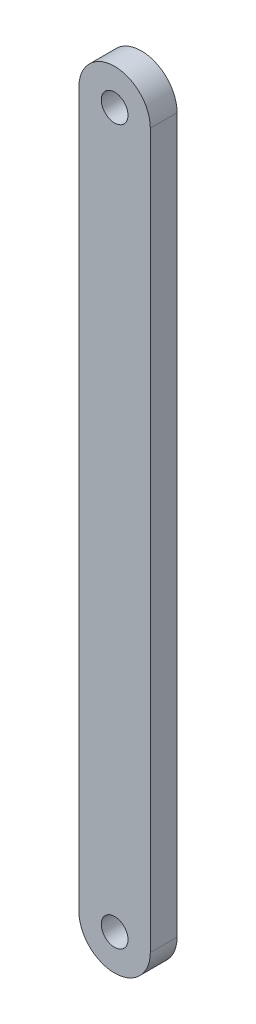
ISO-10303-21;
HEADER;
FILE_DESCRIPTION(('STEP AP214'),'2;1');
FILE_NAME('part.step','',(''),(''),'','','');
FILE_SCHEMA(('AUTOMOTIVE_DESIGN { 1 0 10303 214 1 1 1 1 }'));
ENDSEC;
DATA;
#1=APPLICATION_CONTEXT('core data for automotive mechanical design processes');
#2=APPLICATION_PROTOCOL_DEFINITION('international standard','automotive_design',2000,#1);
#3=PRODUCT_CONTEXT('',#1,'mechanical');
#4=PRODUCT('Part','Part','',(#3));
#5=PRODUCT_RELATED_PRODUCT_CATEGORY('part','',(#4));
#6=PRODUCT_DEFINITION_FORMATION('','',#4);
#7=PRODUCT_DEFINITION_CONTEXT('part definition',#1,'design');
#8=PRODUCT_DEFINITION('design','',#6,#7);
#9=PRODUCT_DEFINITION_SHAPE('','',#8);
#10=(LENGTH_UNIT() NAMED_UNIT(*) SI_UNIT(.MILLI.,.METRE.));
#11=(NAMED_UNIT(*) PLANE_ANGLE_UNIT() SI_UNIT($,.RADIAN.));
#12=(NAMED_UNIT(*) SI_UNIT($,.STERADIAN.) SOLID_ANGLE_UNIT());
#13=UNCERTAINTY_MEASURE_WITH_UNIT(LENGTH_MEASURE(1.E-05),#10,'distance_accuracy_value','');
#14=(GEOMETRIC_REPRESENTATION_CONTEXT(3) GLOBAL_UNCERTAINTY_ASSIGNED_CONTEXT((#13)) GLOBAL_UNIT_ASSIGNED_CONTEXT((#10,
#11,#12)) REPRESENTATION_CONTEXT('',''));
#15=CARTESIAN_POINT('',(0.,0.,0.));
#16=DIRECTION('',(0.,0.,1.));
#17=DIRECTION('',(1.,0.,0.));
#18=AXIS2_PLACEMENT_3D('',#15,#16,#17);
#19=CARTESIAN_POINT('',(51.4999999987979,80.0001000004622,3.));
#20=DIRECTION('',(0.,0.,1.));
#21=DIRECTION('',(1.,0.,0.));
#22=AXIS2_PLACEMENT_3D('',#19,#20,#21);
#23=PLANE('',#22);
#24=CARTESIAN_POINT('',(51.5000999977619,4.99977620052E-05,3.));
#25=DIRECTION('',(0.,0.,1.));
#26=DIRECTION('',(1.,0.,0.));
#27=AXIS2_PLACEMENT_3D('',#24,#25,#26);
#28=CIRCLE('',#27,1.5);
#29=CARTESIAN_POINT('',(53.0000999977619,4.99977620052E-05,3.));
#30=VERTEX_POINT('',#29);
#31=EDGE_CURVE('E102',#30,#30,#28,.T.);
#32=ORIENTED_EDGE('',*,*,#31,.F.);
#33=EDGE_LOOP('',(#32));
#34=FACE_BOUND('',#33,.T.);
#35=CARTESIAN_POINT('',(51.4999999987979,80.0001000004622,3.));
#36=DIRECTION('',(0.,0.,1.));
#37=DIRECTION('',(1.,0.,0.));
#38=AXIS2_PLACEMENT_3D('',#35,#36,#37);
#39=CIRCLE('',#38,3.99989999973548);
#40=CARTESIAN_POINT('',(55.4998999982209,80.0000500009245,3.));
#41=VERTEX_POINT('',#40);
#42=CARTESIAN_POINT('',(47.5000999993749,80.00015,3.));
#43=VERTEX_POINT('',#42);
#44=EDGE_CURVE('E87',#41,#43,#39,.T.);
#45=ORIENTED_EDGE('',*,*,#44,.T.);
#46=DIRECTION('',(0.,-1.,0.));
#47=VECTOR('',#46,1.);
#48=CARTESIAN_POINT('',(47.5000999993749,80.00015,3.));
#49=LINE('',#48,#47);
#50=CARTESIAN_POINT('',(47.500099999375,4.99993777578614E-05,3.));
#51=VERTEX_POINT('',#50);
#52=EDGE_CURVE('E82',#43,#51,#49,.T.);
#53=ORIENTED_EDGE('',*,*,#52,.T.);
#54=CARTESIAN_POINT('',(51.4999999987979,4.99993777591479E-05,3.));
#55=DIRECTION('',(0.,0.,1.));
#56=DIRECTION('',(1.,0.,0.));
#57=AXIS2_PLACEMENT_3D('',#54,#55,#56);
#58=CIRCLE('',#57,3.99989999942295);
#59=CARTESIAN_POINT('',(55.4998999982209,4.99993777617958E-05,3.));
#60=VERTEX_POINT('',#59);
#61=EDGE_CURVE('E85',#51,#60,#58,.T.);
#62=ORIENTED_EDGE('',*,*,#61,.T.);
#63=DIRECTION('',(0.,1.,0.));
#64=VECTOR('',#63,1.);
#65=CARTESIAN_POINT('',(55.4998999982209,80.0000500009245,3.));
#66=LINE('',#65,#64);
#67=EDGE_CURVE('E52',#60,#41,#66,.T.);
#68=ORIENTED_EDGE('',*,*,#67,.T.);
#69=EDGE_LOOP('',(#45,#53,#62,#68));
#70=FACE_BOUND('',#69,.T.);
#71=CARTESIAN_POINT('',(51.5000999977621,80.000049997762,3.));
#72=DIRECTION('',(0.,0.,1.));
#73=DIRECTION('',(1.,0.,0.));
#74=AXIS2_PLACEMENT_3D('',#71,#72,#73);
#75=CIRCLE('',#74,1.5);
#76=CARTESIAN_POINT('',(53.0000999977621,80.000049997762,3.));
#77=VERTEX_POINT('',#76);
#78=EDGE_CURVE('E117',#77,#77,#75,.T.);
#79=ORIENTED_EDGE('',*,*,#78,.F.);
#80=EDGE_LOOP('',(#79));
#81=FACE_BOUND('',#80,.T.);
#82=ADVANCED_FACE('F35',(#34,#70,#81),#23,.T.);
#83=CARTESIAN_POINT('',(51.4999999987979,80.0001000004622,0.));
#84=DIRECTION('',(0.,0.,1.));
#85=DIRECTION('',(1.,0.,0.));
#86=AXIS2_PLACEMENT_3D('',#83,#84,#85);
#87=PLANE('',#86);
#88=CARTESIAN_POINT('',(51.4999999987979,80.0001000004622,0.));
#89=DIRECTION('',(0.,0.,1.));
#90=DIRECTION('',(1.,0.,0.));
#91=AXIS2_PLACEMENT_3D('',#88,#89,#90);
#92=CIRCLE('',#91,3.99989999973548);
#93=CARTESIAN_POINT('',(55.4998999982209,80.0000500009245,0.));
#94=VERTEX_POINT('',#93);
#95=CARTESIAN_POINT('',(47.5000999993749,80.00015,0.));
#96=VERTEX_POINT('',#95);
#97=EDGE_CURVE('E99',#94,#96,#92,.T.);
#98=ORIENTED_EDGE('',*,*,#97,.F.);
#99=DIRECTION('',(0.,1.,0.));
#100=VECTOR('',#99,1.);
#101=CARTESIAN_POINT('',(55.4998999982209,80.0000500009245,0.));
#102=LINE('',#101,#100);
#103=CARTESIAN_POINT('',(55.4998999982209,4.99993777617958E-05,0.));
#104=VERTEX_POINT('',#103);
#105=EDGE_CURVE('E75',#104,#94,#102,.T.);
#106=ORIENTED_EDGE('',*,*,#105,.F.);
#107=CARTESIAN_POINT('',(51.4999999987979,4.99993777591479E-05,0.));
#108=DIRECTION('',(0.,0.,1.));
#109=DIRECTION('',(1.,0.,0.));
#110=AXIS2_PLACEMENT_3D('',#107,#108,#109);
#111=CIRCLE('',#110,3.99989999942295);
#112=CARTESIAN_POINT('',(47.500099999375,4.99993777578614E-05,0.));
#113=VERTEX_POINT('',#112);
#114=EDGE_CURVE('E69',#113,#104,#111,.T.);
#115=ORIENTED_EDGE('',*,*,#114,.F.);
#116=DIRECTION('',(0.,-1.,0.));
#117=VECTOR('',#116,1.);
#118=CARTESIAN_POINT('',(47.5000999993749,80.00015,0.));
#119=LINE('',#118,#117);
#120=EDGE_CURVE('E91',#96,#113,#119,.T.);
#121=ORIENTED_EDGE('',*,*,#120,.F.);
#122=EDGE_LOOP('',(#98,#106,#115,#121));
#123=FACE_BOUND('',#122,.T.);
#124=CARTESIAN_POINT('',(51.5000999977619,4.99977620052E-05,0.));
#125=DIRECTION('',(0.,0.,1.));
#126=DIRECTION('',(1.,0.,0.));
#127=AXIS2_PLACEMENT_3D('',#124,#125,#126);
#128=CIRCLE('',#127,1.5);
#129=CARTESIAN_POINT('',(53.0000999977619,4.99977620052E-05,0.));
#130=VERTEX_POINT('',#129);
#131=EDGE_CURVE('E114',#130,#130,#128,.T.);
#132=ORIENTED_EDGE('',*,*,#131,.T.);
#133=EDGE_LOOP('',(#132));
#134=FACE_BOUND('',#133,.T.);
#135=CARTESIAN_POINT('',(51.5000999977621,80.000049997762,0.));
#136=DIRECTION('',(0.,0.,1.));
#137=DIRECTION('',(1.,0.,0.));
#138=AXIS2_PLACEMENT_3D('',#135,#136,#137);
#139=CIRCLE('',#138,1.5);
#140=CARTESIAN_POINT('',(53.0000999977621,80.000049997762,0.));
#141=VERTEX_POINT('',#140);
#142=EDGE_CURVE('E120',#141,#141,#139,.T.);
#143=ORIENTED_EDGE('',*,*,#142,.T.);
#144=EDGE_LOOP('',(#143));
#145=FACE_BOUND('',#144,.T.);
#146=ADVANCED_FACE('F110',(#123,#134,#145),#87,.F.);
#147=CARTESIAN_POINT('',(51.4999999987979,80.0001000004622,3.));
#148=DIRECTION('',(0.,0.,-1.));
#149=DIRECTION('',(-1.,0.,0.));
#150=AXIS2_PLACEMENT_3D('',#147,#148,#149);
#151=CYLINDRICAL_SURFACE('',#150,3.99989999973548);
#152=ORIENTED_EDGE('',*,*,#97,.T.);
#153=DIRECTION('',(0.,0.,-1.));
#154=VECTOR('',#153,1.);
#155=CARTESIAN_POINT('',(47.5000999993749,80.00015,3.));
#156=LINE('',#155,#154);
#157=EDGE_CURVE('E11',#43,#96,#156,.T.);
#158=ORIENTED_EDGE('',*,*,#157,.F.);
#159=ORIENTED_EDGE('',*,*,#44,.F.);
#160=DIRECTION('',(0.,0.,-1.));
#161=VECTOR('',#160,1.);
#162=CARTESIAN_POINT('',(55.4998999982209,80.0000500009245,3.));
#163=LINE('',#162,#161);
#164=EDGE_CURVE('E95',#41,#94,#163,.T.);
#165=ORIENTED_EDGE('',*,*,#164,.T.);
#166=EDGE_LOOP('',(#152,#158,#159,#165));
#167=FACE_BOUND('',#166,.T.);
#168=ADVANCED_FACE('F37',(#167),#151,.T.);
#169=CARTESIAN_POINT('',(47.5000999993749,80.00015,3.));
#170=DIRECTION('',(1.,0.,0.));
#171=DIRECTION('',(0.,1.,0.));
#172=AXIS2_PLACEMENT_3D('',#169,#170,#171);
#173=PLANE('',#172);
#174=ORIENTED_EDGE('',*,*,#120,.T.);
#175=DIRECTION('',(0.,0.,-1.));
#176=VECTOR('',#175,1.);
#177=CARTESIAN_POINT('',(47.500099999375,4.99993777578614E-05,3.));
#178=LINE('',#177,#176);
#179=EDGE_CURVE('E44',#51,#113,#178,.T.);
#180=ORIENTED_EDGE('',*,*,#179,.F.);
#181=ORIENTED_EDGE('',*,*,#52,.F.);
#182=ORIENTED_EDGE('',*,*,#157,.T.);
#183=EDGE_LOOP('',(#174,#180,#181,#182));
#184=FACE_BOUND('',#183,.T.);
#185=ADVANCED_FACE('F90',(#184),#173,.F.);
#186=CARTESIAN_POINT('',(51.4999999987979,4.99993777591479E-05,3.));
#187=DIRECTION('',(0.,0.,-1.));
#188=DIRECTION('',(-1.,0.,0.));
#189=AXIS2_PLACEMENT_3D('',#186,#187,#188);
#190=CYLINDRICAL_SURFACE('',#189,3.99989999942295);
#191=ORIENTED_EDGE('',*,*,#114,.T.);
#192=DIRECTION('',(0.,0.,-1.));
#193=VECTOR('',#192,1.);
#194=CARTESIAN_POINT('',(55.4998999982209,4.99993777617958E-05,3.));
#195=LINE('',#194,#193);
#196=EDGE_CURVE('E92',#60,#104,#195,.T.);
#197=ORIENTED_EDGE('',*,*,#196,.F.);
#198=ORIENTED_EDGE('',*,*,#61,.F.);
#199=ORIENTED_EDGE('',*,*,#179,.T.);
#200=EDGE_LOOP('',(#191,#197,#198,#199));
#201=FACE_BOUND('',#200,.T.);
#202=ADVANCED_FACE('F93',(#201),#190,.T.);
#203=CARTESIAN_POINT('',(55.4998999982209,80.0000500009245,3.));
#204=DIRECTION('',(-1.,0.,0.));
#205=DIRECTION('',(0.,0.,1.));
#206=AXIS2_PLACEMENT_3D('',#203,#204,#205);
#207=PLANE('',#206);
#208=ORIENTED_EDGE('',*,*,#105,.T.);
#209=ORIENTED_EDGE('',*,*,#164,.F.);
#210=ORIENTED_EDGE('',*,*,#67,.F.);
#211=ORIENTED_EDGE('',*,*,#196,.T.);
#212=EDGE_LOOP('',(#208,#209,#210,#211));
#213=FACE_BOUND('',#212,.T.);
#214=ADVANCED_FACE('F107',(#213),#207,.F.);
#215=CARTESIAN_POINT('',(51.5000999977619,4.99977620052E-05,3.));
#216=DIRECTION('',(0.,0.,-1.));
#217=DIRECTION('',(-1.,0.,0.));
#218=AXIS2_PLACEMENT_3D('',#215,#216,#217);
#219=CYLINDRICAL_SURFACE('',#218,1.5);
#220=ORIENTED_EDGE('',*,*,#31,.T.);
#221=EDGE_LOOP('',(#220));
#222=FACE_BOUND('',#221,.T.);
#223=ORIENTED_EDGE('',*,*,#131,.F.);
#224=EDGE_LOOP('',(#223));
#225=FACE_BOUND('',#224,.T.);
#226=ADVANCED_FACE('F137',(#222,#225),#219,.F.);
#227=CARTESIAN_POINT('',(51.5000999977621,80.000049997762,3.));
#228=DIRECTION('',(0.,0.,-1.));
#229=DIRECTION('',(-1.,0.,0.));
#230=AXIS2_PLACEMENT_3D('',#227,#228,#229);
#231=CYLINDRICAL_SURFACE('',#230,1.5);
#232=ORIENTED_EDGE('',*,*,#78,.T.);
#233=EDGE_LOOP('',(#232));
#234=FACE_BOUND('',#233,.T.);
#235=ORIENTED_EDGE('',*,*,#142,.F.);
#236=EDGE_LOOP('',(#235));
#237=FACE_BOUND('',#236,.T.);
#238=ADVANCED_FACE('F126',(#234,#237),#231,.F.);
#239=CLOSED_SHELL('',(#82,#146,#168,#185,#202,#214,#226,#238));
#240=MANIFOLD_SOLID_BREP('B2',#239);
#241=ADVANCED_BREP_SHAPE_REPRESENTATION('',(#18,#240),#14);
#242=SHAPE_DEFINITION_REPRESENTATION(#9,#241);
ENDSEC;
END-ISO-10303-21;
